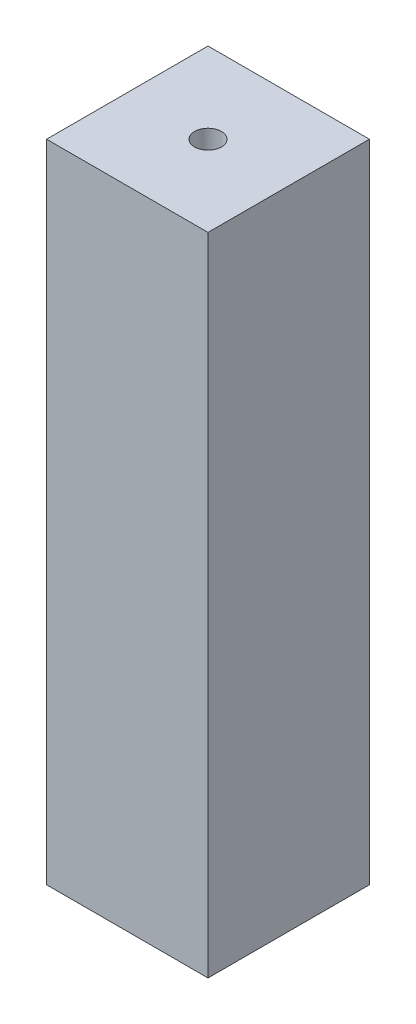
ISO-10303-21;
HEADER;
FILE_DESCRIPTION(('STEP AP214'),'2;1');
FILE_NAME('part.step','',(''),(''),'','','');
FILE_SCHEMA(('AUTOMOTIVE_DESIGN { 1 0 10303 214 1 1 1 1 }'));
ENDSEC;
DATA;
#1=APPLICATION_CONTEXT('core data for automotive mechanical design processes');
#2=APPLICATION_PROTOCOL_DEFINITION('international standard','automotive_design',2000,#1);
#3=PRODUCT_CONTEXT('',#1,'mechanical');
#4=PRODUCT('Part','Part','',(#3));
#5=PRODUCT_RELATED_PRODUCT_CATEGORY('part','',(#4));
#6=PRODUCT_DEFINITION_FORMATION('','',#4);
#7=PRODUCT_DEFINITION_CONTEXT('part definition',#1,'design');
#8=PRODUCT_DEFINITION('design','',#6,#7);
#9=PRODUCT_DEFINITION_SHAPE('','',#8);
#10=(LENGTH_UNIT() NAMED_UNIT(*) SI_UNIT(.MILLI.,.METRE.));
#11=(NAMED_UNIT(*) PLANE_ANGLE_UNIT() SI_UNIT($,.RADIAN.));
#12=(NAMED_UNIT(*) SI_UNIT($,.STERADIAN.) SOLID_ANGLE_UNIT());
#13=UNCERTAINTY_MEASURE_WITH_UNIT(LENGTH_MEASURE(1.E-05),#10,'distance_accuracy_value','');
#14=(GEOMETRIC_REPRESENTATION_CONTEXT(3) GLOBAL_UNCERTAINTY_ASSIGNED_CONTEXT((#13)) GLOBAL_UNIT_ASSIGNED_CONTEXT((#10,
#11,#12)) REPRESENTATION_CONTEXT('',''));
#15=CARTESIAN_POINT('',(0.,0.,0.));
#16=DIRECTION('',(0.,0.,1.));
#17=DIRECTION('',(1.,0.,0.));
#18=AXIS2_PLACEMENT_3D('',#15,#16,#17);
#19=CARTESIAN_POINT('',(0.,60.,0.));
#20=DIRECTION('',(1.,0.,0.));
#21=DIRECTION('',(0.,0.,-1.));
#22=AXIS2_PLACEMENT_3D('',#19,#20,#21);
#23=PLANE('',#22);
#24=DIRECTION('',(0.,0.,1.));
#25=VECTOR('',#24,1.);
#26=CARTESIAN_POINT('',(0.,0.,0.));
#27=LINE('',#26,#25);
#28=CARTESIAN_POINT('',(0.,0.,-15.));
#29=VERTEX_POINT('',#28);
#30=CARTESIAN_POINT('',(0.,0.,0.));
#31=VERTEX_POINT('',#30);
#32=EDGE_CURVE('E107',#29,#31,#27,.T.);
#33=ORIENTED_EDGE('',*,*,#32,.T.);
#34=DIRECTION('',(0.,-1.,0.));
#35=VECTOR('',#34,1.);
#36=CARTESIAN_POINT('',(0.,60.,0.));
#37=LINE('',#36,#35);
#38=CARTESIAN_POINT('',(0.,60.,0.));
#39=VERTEX_POINT('',#38);
#40=EDGE_CURVE('E11',#39,#31,#37,.T.);
#41=ORIENTED_EDGE('',*,*,#40,.F.);
#42=DIRECTION('',(0.,0.,1.));
#43=VECTOR('',#42,1.);
#44=CARTESIAN_POINT('',(0.,60.,0.));
#45=LINE('',#44,#43);
#46=CARTESIAN_POINT('',(0.,60.,-15.));
#47=VERTEX_POINT('',#46);
#48=EDGE_CURVE('E91',#47,#39,#45,.T.);
#49=ORIENTED_EDGE('',*,*,#48,.F.);
#50=DIRECTION('',(0.,-1.,0.));
#51=VECTOR('',#50,1.);
#52=CARTESIAN_POINT('',(0.,60.,-15.));
#53=LINE('',#52,#51);
#54=EDGE_CURVE('E103',#47,#29,#53,.T.);
#55=ORIENTED_EDGE('',*,*,#54,.T.);
#56=EDGE_LOOP('',(#33,#41,#49,#55));
#57=FACE_BOUND('',#56,.T.);
#58=ADVANCED_FACE('F39',(#57),#23,.F.);
#59=CARTESIAN_POINT('',(0.,60.,0.));
#60=DIRECTION('',(0.,0.,-1.));
#61=DIRECTION('',(-1.,0.,0.));
#62=AXIS2_PLACEMENT_3D('',#59,#60,#61);
#63=PLANE('',#62);
#64=DIRECTION('',(1.,0.,0.));
#65=VECTOR('',#64,1.);
#66=CARTESIAN_POINT('',(0.,0.,0.));
#67=LINE('',#66,#65);
#68=CARTESIAN_POINT('',(15.,0.,0.));
#69=VERTEX_POINT('',#68);
#70=EDGE_CURVE('E96',#31,#69,#67,.T.);
#71=ORIENTED_EDGE('',*,*,#70,.T.);
#72=DIRECTION('',(0.,-1.,0.));
#73=VECTOR('',#72,1.);
#74=CARTESIAN_POINT('',(15.,60.,0.));
#75=LINE('',#74,#73);
#76=CARTESIAN_POINT('',(15.,60.,0.));
#77=VERTEX_POINT('',#76);
#78=EDGE_CURVE('E48',#77,#69,#75,.T.);
#79=ORIENTED_EDGE('',*,*,#78,.F.);
#80=DIRECTION('',(1.,0.,0.));
#81=VECTOR('',#80,1.);
#82=CARTESIAN_POINT('',(0.,60.,0.));
#83=LINE('',#82,#81);
#84=EDGE_CURVE('E86',#39,#77,#83,.T.);
#85=ORIENTED_EDGE('',*,*,#84,.F.);
#86=ORIENTED_EDGE('',*,*,#40,.T.);
#87=EDGE_LOOP('',(#71,#79,#85,#86));
#88=FACE_BOUND('',#87,.T.);
#89=ADVANCED_FACE('F95',(#88),#63,.F.);
#90=CARTESIAN_POINT('',(15.,60.,0.));
#91=DIRECTION('',(-1.,0.,0.));
#92=DIRECTION('',(0.,0.,1.));
#93=AXIS2_PLACEMENT_3D('',#90,#91,#92);
#94=PLANE('',#93);
#95=DIRECTION('',(0.,0.,-1.));
#96=VECTOR('',#95,1.);
#97=CARTESIAN_POINT('',(15.,0.,0.));
#98=LINE('',#97,#96);
#99=CARTESIAN_POINT('',(15.,0.,-15.));
#100=VERTEX_POINT('',#99);
#101=EDGE_CURVE('E73',#69,#100,#98,.T.);
#102=ORIENTED_EDGE('',*,*,#101,.T.);
#103=DIRECTION('',(0.,-1.,0.));
#104=VECTOR('',#103,1.);
#105=CARTESIAN_POINT('',(15.,60.,-15.));
#106=LINE('',#105,#104);
#107=CARTESIAN_POINT('',(15.,60.,-15.));
#108=VERTEX_POINT('',#107);
#109=EDGE_CURVE('E98',#108,#100,#106,.T.);
#110=ORIENTED_EDGE('',*,*,#109,.F.);
#111=DIRECTION('',(0.,0.,-1.));
#112=VECTOR('',#111,1.);
#113=CARTESIAN_POINT('',(15.,60.,0.));
#114=LINE('',#113,#112);
#115=EDGE_CURVE('E89',#77,#108,#114,.T.);
#116=ORIENTED_EDGE('',*,*,#115,.F.);
#117=ORIENTED_EDGE('',*,*,#78,.T.);
#118=EDGE_LOOP('',(#102,#110,#116,#117));
#119=FACE_BOUND('',#118,.T.);
#120=ADVANCED_FACE('F99',(#119),#94,.F.);
#121=CARTESIAN_POINT('',(0.,60.,-15.));
#122=DIRECTION('',(0.,0.,1.));
#123=DIRECTION('',(1.,0.,0.));
#124=AXIS2_PLACEMENT_3D('',#121,#122,#123);
#125=PLANE('',#124);
#126=DIRECTION('',(-1.,0.,0.));
#127=VECTOR('',#126,1.);
#128=CARTESIAN_POINT('',(0.,0.,-15.));
#129=LINE('',#128,#127);
#130=EDGE_CURVE('E79',#100,#29,#129,.T.);
#131=ORIENTED_EDGE('',*,*,#130,.T.);
#132=ORIENTED_EDGE('',*,*,#54,.F.);
#133=DIRECTION('',(-1.,0.,0.));
#134=VECTOR('',#133,1.);
#135=CARTESIAN_POINT('',(0.,60.,-15.));
#136=LINE('',#135,#134);
#137=EDGE_CURVE('E56',#108,#47,#136,.T.);
#138=ORIENTED_EDGE('',*,*,#137,.F.);
#139=ORIENTED_EDGE('',*,*,#109,.T.);
#140=EDGE_LOOP('',(#131,#132,#138,#139));
#141=FACE_BOUND('',#140,.T.);
#142=ADVANCED_FACE('F121',(#141),#125,.F.);
#143=CARTESIAN_POINT('',(0.,60.,0.));
#144=DIRECTION('',(0.,-1.,0.));
#145=DIRECTION('',(0.,0.,-1.));
#146=AXIS2_PLACEMENT_3D('',#143,#144,#145);
#147=PLANE('',#146);
#148=CARTESIAN_POINT('',(7.5,60.,-7.5));
#149=DIRECTION('',(0.,1.,0.));
#150=DIRECTION('',(0.,0.,1.));
#151=AXIS2_PLACEMENT_3D('',#148,#149,#150);
#152=CIRCLE('',#151,1.25);
#153=CARTESIAN_POINT('',(7.5,60.,-6.25));
#154=VERTEX_POINT('',#153);
#155=EDGE_CURVE('E128',#154,#154,#152,.T.);
#156=ORIENTED_EDGE('',*,*,#155,.F.);
#157=EDGE_LOOP('',(#156));
#158=FACE_BOUND('',#157,.T.);
#159=ORIENTED_EDGE('',*,*,#48,.T.);
#160=ORIENTED_EDGE('',*,*,#84,.T.);
#161=ORIENTED_EDGE('',*,*,#115,.T.);
#162=ORIENTED_EDGE('',*,*,#137,.T.);
#163=EDGE_LOOP('',(#159,#160,#161,#162));
#164=FACE_BOUND('',#163,.T.);
#165=ADVANCED_FACE('F87',(#158,#164),#147,.F.);
#166=CARTESIAN_POINT('',(0.,0.,0.));
#167=DIRECTION('',(0.,-1.,0.));
#168=DIRECTION('',(0.,0.,-1.));
#169=AXIS2_PLACEMENT_3D('',#166,#167,#168);
#170=PLANE('',#169);
#171=CARTESIAN_POINT('',(7.5,0.,-7.5));
#172=DIRECTION('',(0.,1.,0.));
#173=DIRECTION('',(0.,0.,1.));
#174=AXIS2_PLACEMENT_3D('',#171,#172,#173);
#175=CIRCLE('',#174,1.25);
#176=CARTESIAN_POINT('',(7.5,0.,-6.25));
#177=VERTEX_POINT('',#176);
#178=EDGE_CURVE('E111',#177,#177,#175,.T.);
#179=ORIENTED_EDGE('',*,*,#178,.T.);
#180=EDGE_LOOP('',(#179));
#181=FACE_BOUND('',#180,.T.);
#182=ORIENTED_EDGE('',*,*,#32,.F.);
#183=ORIENTED_EDGE('',*,*,#130,.F.);
#184=ORIENTED_EDGE('',*,*,#101,.F.);
#185=ORIENTED_EDGE('',*,*,#70,.F.);
#186=EDGE_LOOP('',(#182,#183,#184,#185));
#187=FACE_BOUND('',#186,.T.);
#188=ADVANCED_FACE('F124',(#181,#187),#170,.T.);
#189=CARTESIAN_POINT('',(7.5,0.,-7.5));
#190=DIRECTION('',(0.,1.,0.));
#191=DIRECTION('',(0.,0.,1.));
#192=AXIS2_PLACEMENT_3D('',#189,#190,#191);
#193=CYLINDRICAL_SURFACE('',#192,1.25);
#194=ORIENTED_EDGE('',*,*,#178,.F.);
#195=EDGE_LOOP('',(#194));
#196=FACE_BOUND('',#195,.T.);
#197=ORIENTED_EDGE('',*,*,#155,.T.);
#198=EDGE_LOOP('',(#197));
#199=FACE_BOUND('',#198,.T.);
#200=ADVANCED_FACE('F137',(#196,#199),#193,.F.);
#201=CLOSED_SHELL('',(#58,#89,#120,#142,#165,#188,#200));
#202=MANIFOLD_SOLID_BREP('B2',#201);
#203=ADVANCED_BREP_SHAPE_REPRESENTATION('',(#18,#202),#14);
#204=SHAPE_DEFINITION_REPRESENTATION(#9,#203);
ENDSEC;
END-ISO-10303-21;
